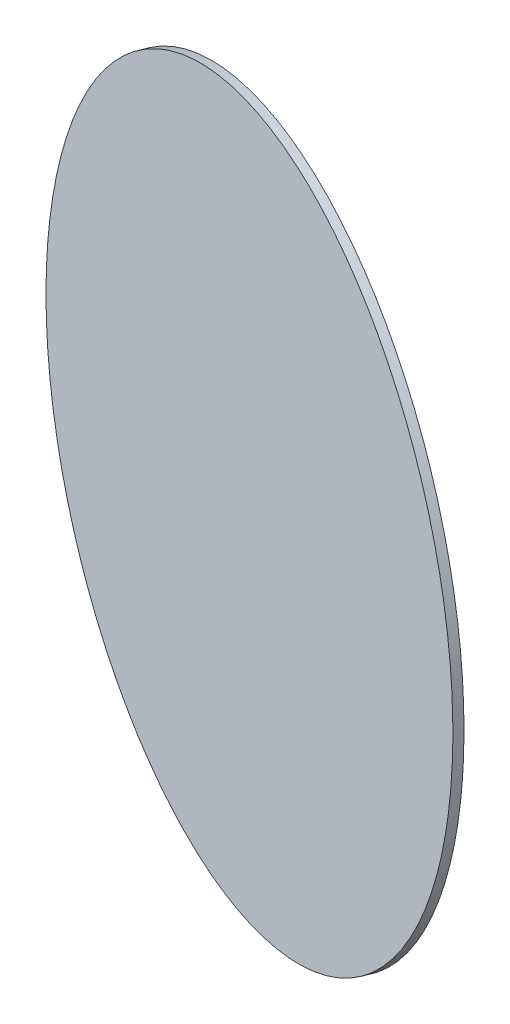
ISO-10303-21;
HEADER;
FILE_DESCRIPTION(('STEP AP214'),'2;1');
FILE_NAME('part.step','',(''),(''),'','','');
FILE_SCHEMA(('AUTOMOTIVE_DESIGN { 1 0 10303 214 1 1 1 1 }'));
ENDSEC;
DATA;
#1=APPLICATION_CONTEXT('core data for automotive mechanical design processes');
#2=APPLICATION_PROTOCOL_DEFINITION('international standard','automotive_design',2000,#1);
#3=PRODUCT_CONTEXT('',#1,'mechanical');
#4=PRODUCT('Part','Part','',(#3));
#5=PRODUCT_RELATED_PRODUCT_CATEGORY('part','',(#4));
#6=PRODUCT_DEFINITION_FORMATION('','',#4);
#7=PRODUCT_DEFINITION_CONTEXT('part definition',#1,'design');
#8=PRODUCT_DEFINITION('design','',#6,#7);
#9=PRODUCT_DEFINITION_SHAPE('','',#8);
#10=(LENGTH_UNIT() NAMED_UNIT(*) SI_UNIT(.MILLI.,.METRE.));
#11=(NAMED_UNIT(*) PLANE_ANGLE_UNIT() SI_UNIT($,.RADIAN.));
#12=(NAMED_UNIT(*) SI_UNIT($,.STERADIAN.) SOLID_ANGLE_UNIT());
#13=UNCERTAINTY_MEASURE_WITH_UNIT(LENGTH_MEASURE(1.E-05),#10,'distance_accuracy_value','');
#14=(GEOMETRIC_REPRESENTATION_CONTEXT(3) GLOBAL_UNCERTAINTY_ASSIGNED_CONTEXT((#13)) GLOBAL_UNIT_ASSIGNED_CONTEXT((#10,
#11,#12)) REPRESENTATION_CONTEXT('',''));
#15=CARTESIAN_POINT('',(0.,0.,0.));
#16=DIRECTION('',(0.,0.,1.));
#17=DIRECTION('',(1.,0.,0.));
#18=AXIS2_PLACEMENT_3D('',#15,#16,#17);
#19=CARTESIAN_POINT('',(143.675537707486,64.4027881770148,553.737754131738));
#20=CARTESIAN_POINT('',(143.57770294514,55.9951290307096,554.009753420422));
#21=CARTESIAN_POINT('',(142.60424510311,39.1798107380994,554.273991210363));
#22=CARTESIAN_POINT('',(138.824755784797,14.1997443602028,553.827248401444));
#23=CARTESIAN_POINT('',(132.762362459431,-10.2968392619625,552.541708476158));
#24=CARTESIAN_POINT('',(124.475449288777,-34.0740246369204,550.429751886734));
#25=CARTESIAN_POINT('',(114.043823776756,-56.9028244715783,547.511717929642));
#26=CARTESIAN_POINT('',(101.567948179554,-78.563384944037,543.815708867046));
#27=CARTESIAN_POINT('',(87.1679719991806,-98.84710301608,539.377319286665));
#28=CARTESIAN_POINT('',(70.9825748780801,-117.558635394465,534.239293306427));
#29=CARTESIAN_POINT('',(53.1676310383668,-134.517779793625,528.451112925254));
#30=CARTESIAN_POINT('',(33.8947081278563,-149.561210382183,522.068521484357));
#31=CARTESIAN_POINT('',(13.3494149298276,-162.544050699997,515.152986828391));
#32=CARTESIAN_POINT('',(-8.27038615102185,-173.341268897664,507.77110933651));
#33=CARTESIAN_POINT('',(-30.7564846116986,-181.84888186158,499.993980524303));
#34=CARTESIAN_POINT('',(-53.8923270318742,-187.984956628169,491.896498393646));
#35=CARTESIAN_POINT('',(-77.4551026017046,-191.690399443107,483.556646123989));
#36=CARTESIAN_POINT('',(-101.217888911729,-192.929524866487,475.054741051716));
#37=CARTESIAN_POINT('',(-124.951837339721,-191.690399443107,466.472661170287));
#38=CARTESIAN_POINT('',(-148.428376988024,-187.984956628169,457.893056600404));
#39=CARTESIAN_POINT('',(-171.421415946242,-181.84888186158,449.398553624161));
#40=CARTESIAN_POINT('',(-193.709518679934,-173.341268897664,441.070958948789));
#41=CARTESIAN_POINT('',(-215.078038575858,-162.544050699998,432.990471863338));
#42=CARTESIAN_POINT('',(-235.321185106195,-149.561210382183,425.234911875683));
#43=CARTESIAN_POINT('',(-254.244005703829,-134.517779793625,417.878969268127));
#44=CARTESIAN_POINT('',(-271.664263262139,-117.558635394465,410.993485789148));
#45=CARTESIAN_POINT('',(-287.414191177956,-98.8471030160799,404.644772408636));
#46=CARTESIAN_POINT('',(-301.342109035664,-78.563384944037,398.893970707005));
#47=CARTESIAN_POINT('',(-313.313883372521,-56.9028244715783,393.79646404835));
#48=CARTESIAN_POINT('',(-323.214219457223,-34.0740246369205,389.401344208375));
#49=CARTESIAN_POINT('',(-330.947771641201,-10.2968392619627,385.750938593755));
#50=CARTESIAN_POINT('',(-336.440061589335,14.1997443602027,382.880402606073));
#51=CARTESIAN_POINT('',(-339.638195547032,39.1798107380994,380.817381076087));
#52=CARTESIAN_POINT('',(-340.511373736001,64.4027881770146,379.581742028891));
#53=CARTESIAN_POINT('',(-339.051186972956,89.6257656159303,379.18538534398));
#54=CARTESIAN_POINT('',(-335.271697654643,114.605831993827,379.632128152899));
#55=CARTESIAN_POINT('',(-329.209304329278,139.102415615992,380.917668078185));
#56=CARTESIAN_POINT('',(-320.922391158624,162.87960099095,383.029624667608));
#57=CARTESIAN_POINT('',(-310.490765646602,185.708400825608,385.947658624701));
#58=CARTESIAN_POINT('',(-298.0148900494,207.368961298066,389.643667687297));
#59=CARTESIAN_POINT('',(-283.614913869027,227.652679370109,394.082057267678));
#60=CARTESIAN_POINT('',(-267.429516747926,246.364211748495,399.220083247915));
#61=CARTESIAN_POINT('',(-249.614572908213,263.323356147654,405.008263629089));
#62=CARTESIAN_POINT('',(-230.341649997702,278.366786736213,411.390855069986));
#63=CARTESIAN_POINT('',(-209.796356799674,291.349627054027,418.306389725952));
#64=CARTESIAN_POINT('',(-188.176555718824,302.146845251694,425.688267217833));
#65=CARTESIAN_POINT('',(-165.690457258148,310.65445821561,433.465396030039));
#66=CARTESIAN_POINT('',(-142.554614837972,316.790532982198,441.562878160697));
#67=CARTESIAN_POINT('',(-118.991839268142,320.495975797137,449.902730430354));
#68=CARTESIAN_POINT('',(-95.2290529581174,321.735101220517,458.404635502627));
#69=CARTESIAN_POINT('',(-71.4951045301253,320.495975797137,466.986715384055));
#70=CARTESIAN_POINT('',(-48.0185648818226,316.790532982198,475.566319953939));
#71=CARTESIAN_POINT('',(-25.0255259236047,310.65445821561,484.060822930182));
#72=CARTESIAN_POINT('',(-2.73742318991249,302.146845251694,492.388417605554));
#73=CARTESIAN_POINT('',(18.6310967060115,291.349627054027,500.468904691005));
#74=CARTESIAN_POINT('',(38.8742432363487,278.366786736213,508.224464678659));
#75=CARTESIAN_POINT('',(57.797063833983,263.323356147654,515.580407286216));
#76=CARTESIAN_POINT('',(75.2173213922924,246.364211748495,522.465890765195));
#77=CARTESIAN_POINT('',(90.9672493081095,227.652679370109,528.814604145707));
#78=CARTESIAN_POINT('',(104.895167165818,207.368961298067,534.565405847338));
#79=CARTESIAN_POINT('',(116.866941502674,185.708400825608,539.662912505993));
#80=CARTESIAN_POINT('',(126.767277587377,162.87960099095,544.058032345968));
#81=CARTESIAN_POINT('',(134.500829771355,139.102415615992,547.708437960588));
#82=CARTESIAN_POINT('',(139.993119719489,114.605831993827,550.578973948269));
#83=CARTESIAN_POINT('',(143.191253677186,89.6257656159303,552.641995478256));
#84=CARTESIAN_POINT('',(143.773372469832,72.8104473233199,553.465754843053));
#85=CARTESIAN_POINT('',(143.675537707486,64.4027881770148,553.737754131738));
#86=B_SPLINE_CURVE_WITH_KNOTS('',3,(#19,#20,#21,#22,#23,#24,#25,#26,#27,#28,#29,#30,#31,#32,#33,
#34,#35,#36,#37,#38,#39,#40,#41,#42,#43,#44,#45,#46,#47,#48,#49,#50,#51,#52,#53,#54,#55,#56,#57,
#58,#59,#60,#61,#62,#63,#64,#65,#66,#67,#68,#69,#70,#71,#72,#73,#74,#75,#76,#77,#78,#79,#80,#81,
#82,#83,#84,#85),.UNSPECIFIED.,.T.,.F.,(4,1,1,1,1,1,1,1,1,1,1,1,1,1,1,1,1,1,1,1,1,1,1,1,1,1,1,1,
1,1,1,1,1,1,1,1,1,1,1,1,1,1,1,1,1,1,1,1,1,1,1,1,1,1,1,1,1,1,1,1,1,1,1,1,4),(0.,0.015625,0.03125,
0.046875,0.0625,0.078125,0.09375,0.109375,0.125,0.140625,0.15625,0.171875,0.1875,0.203125,
0.21875,0.234375,0.25,0.265625,0.28125,0.296875,0.3125,0.328125,0.34375,0.359375,0.375,0.390625,
0.40625,0.421875,0.4375,0.453125,0.46875,0.484375,0.5,0.515625,0.53125,0.546875,0.5625,0.578125,
0.59375,0.609375,0.625,0.640625,0.65625,0.671875,0.6875,0.703125,0.71875,0.734375,0.75,0.765625,
0.78125,0.796875,0.8125,0.828125,0.84375,0.859375,0.875,0.890625,0.90625,0.921875,0.9375,
0.953125,0.96875,0.984375,1.),.UNSPECIFIED.);
#87=DIRECTION('',(-0.33825933679832,0.0343601668853414,0.940425435640898));
#88=VECTOR('',#87,1.);
#89=SURFACE_OF_LINEAR_EXTRUSION('',#86,#88);
#90=CARTESIAN_POINT('',(143.675537707486,64.4027881770148,553.737754131738));
#91=CARTESIAN_POINT('',(143.724455088659,68.6066177501673,553.601754487395));
#92=CARTESIAN_POINT('',(143.676148930165,72.8104473233199,553.430784744624));
#93=CARTESIAN_POINT('',(143.385439916478,81.207985175416,553.019400890538));
#94=CARTESIAN_POINT('',(143.143037061286,85.4016934543595,552.778986779223));
#95=CARTESIAN_POINT('',(142.464485036842,93.7688674238281,552.229210016359));
#96=CARTESIAN_POINT('',(142.02833586759,97.9423331143533,551.919847364811));
#97=CARTESIAN_POINT('',(140.963574539119,106.258998086373,551.233001355861));
#98=CARTESIAN_POINT('',(140.334962379902,110.402197367866,550.855517998459));
#99=CARTESIAN_POINT('',(138.886558395597,118.64830570121,550.033258412182));
#100=CARTESIAN_POINT('',(138.066766570509,122.75121475306,549.588482183305));
#101=CARTESIAN_POINT('',(136.238207160906,130.90691281497,548.632788722026));
#102=CARTESIAN_POINT('',(135.22943957639,134.959701825031,548.121871489624));
#103=CARTESIAN_POINT('',(133.025132554372,143.005329991218,547.03504788924));
#104=CARTESIAN_POINT('',(131.829593116869,146.998169147344,546.459141521259));
#105=CARTESIAN_POINT('',(129.254845652839,154.914356468452,545.243804458118));
#106=CARTESIAN_POINT('',(127.875637626313,158.837704633432,544.604373762959));
#107=CARTESIAN_POINT('',(124.936656248199,166.605368835035,543.263452853859));
#108=CARTESIAN_POINT('',(123.376882896612,170.449684871657,542.56196263992));
#109=CARTESIAN_POINT('',(120.080743603735,178.05012424063,541.098686335206));
#110=CARTESIAN_POINT('',(118.344377662445,181.806247572982,540.336900244432));
#111=CARTESIAN_POINT('',(114.699025925519,189.221140957501,538.754795827994));
#112=CARTESIAN_POINT('',(112.790040129882,192.879911009669,537.93447750233));
#113=CARTESIAN_POINT('',(108.804252631401,200.091406040563,536.237354106766));
#114=CARTESIAN_POINT('',(106.727450928556,203.644131019289,535.360549036866));
#115=CARTESIAN_POINT('',(102.410835562796,210.634844110039,533.552497643485));
#116=CARTESIAN_POINT('',(100.17102189988,214.072832222064,532.621251320004));
#117=CARTESIAN_POINT('',(95.5339715082578,220.825932275526,530.706625059631));
#118=CARTESIAN_POINT('',(93.1367347795519,224.141044216964,529.723245122739));
#119=CARTESIAN_POINT('',(88.190427150631,230.640252625369,527.706659275715));
#120=CARTESIAN_POINT('',(85.641356250416,233.824349092335,526.673453365583));
#121=CARTESIAN_POINT('',(80.3977002957943,240.054018123232,524.55976313793));
#122=CARTESIAN_POINT('',(77.7031152413876,243.099590687162,523.479278820408));
#123=CARTESIAN_POINT('',(72.1747509956999,249.044703483419,521.273579343826));
#124=CARTESIAN_POINT('',(69.3409718044189,251.944243715747,520.148364184766));
#125=CARTESIAN_POINT('',(63.5412095601144,257.590486605826,517.855965982185));
#126=CARTESIAN_POINT('',(60.575226507091,260.337189263577,516.688782938664));
#127=CARTESIAN_POINT('',(54.5180468144337,265.67095176153,514.315211924242));
#128=CARTESIAN_POINT('',(51.4268501747998,268.258011601732,513.10882395334));
#129=CARTESIAN_POINT('',(45.1268365216977,273.266451945412,510.659794823674));
#130=CARTESIAN_POINT('',(41.9180195082294,275.687832448891,509.417153664911));
#131=CARTESIAN_POINT('',(35.3903583202341,280.358877599953,506.898569899042));
#132=CARTESIAN_POINT('',(32.0715141457072,282.608542247536,505.622627291938));
#133=CARTESIAN_POINT('',(25.3319216592246,286.930946026416,503.040552724482));
#134=CARTESIAN_POINT('',(21.9111733472689,289.003685157712,501.734420764131));
#135=CARTESIAN_POINT('',(14.9758956095587,292.967028243626,499.09507958528));
#136=CARTESIAN_POINT('',(11.4613661838041,294.857632198243,497.76187036678));
#137=CARTESIAN_POINT('',(4.3471008238219,298.452372301065,495.071617151124));
#138=CARTESIAN_POINT('',(0.747364889594235,300.15650844927,493.714573153969));
#139=CARTESIAN_POINT('',(-6.52873888200846,303.373980309534,490.979892860499));
#140=CARTESIAN_POINT('',(-10.2051067193835,304.887316021593,489.602256564183));
#141=CARTESIAN_POINT('',(-17.6255306883958,307.719773136082,486.829733309436));
#142=CARTESIAN_POINT('',(-21.369586820033,309.038894538513,485.434846351005));
#143=CARTESIAN_POINT('',(-28.9164437686847,311.479509160264,482.631163409069));
#144=CARTESIAN_POINT('',(-32.7192445856991,312.601002379584,481.222367425565));
#145=CARTESIAN_POINT('',(-40.3743644245034,314.64389839535,478.394275046285));
#146=CARTESIAN_POINT('',(-44.2266834462932,315.565301191796,476.97497865051));
#147=CARTESIAN_POINT('',(-51.9716132140466,317.20555412205,474.129294059489));
#148=CARTESIAN_POINT('',(-55.8642239600102,317.924404255859,472.702905864243));
#149=CARTESIAN_POINT('',(-63.6803166798446,319.158064967509,469.846480436036));
#150=CARTESIAN_POINT('',(-67.6037986537154,319.67287554535,468.416443203074));
#151=CARTESIAN_POINT('',(-75.4722133330979,320.496970251737,465.556162461189));
#152=CARTESIAN_POINT('',(-79.4171460386095,320.806254380282,464.125918952265));
#153=CARTESIAN_POINT('',(-87.3189383938711,321.218798960775,461.268669413485));
#154=CARTESIAN_POINT('',(-91.2757980436212,321.322059412724,459.841663383628));
#155=CARTESIAN_POINT('',(-99.1919204999572,321.322059412724,456.994332558011));
#156=CARTESIAN_POINT('',(-103.151183306543,321.218798960775,455.574007762251));
#157=CARTESIAN_POINT('',(-111.062576717292,320.806254380282,452.743450987888));
#158=CARTESIAN_POINT('',(-115.014707321455,320.496970251737,451.333219009284));
#159=CARTESIAN_POINT('',(-122.902300968097,319.67287554535,448.526259452296));
#160=CARTESIAN_POINT('',(-126.837764010577,319.158064967509,447.129531873911));
#161=CARTESIAN_POINT('',(-134.682567433459,317.924404255859,444.352927673041));
#162=CARTESIAN_POINT('',(-138.591907813862,317.20555412205,442.973051050557));
#163=CARTESIAN_POINT('',(-146.375010812197,315.565301191796,440.233495317171));
#164=CARTESIAN_POINT('',(-150.248773430128,314.64389839535,438.87381620627));
#165=CARTESIAN_POINT('',(-157.951437119776,312.601002379584,436.177904795194));
#166=CARTESIAN_POINT('',(-161.780338191493,311.479509160264,434.84167249502));
#167=CARTESIAN_POINT('',(-169.383995004969,309.038894538513,432.195904004543));
#168=CARTESIAN_POINT('',(-173.158750746727,307.719773136082,430.88636781424));
#169=CARTESIAN_POINT('',(-180.645093841106,304.887316021593,428.297112293582));
#170=CARTESIAN_POINT('',(-184.356681193726,303.373980309534,427.017392963228));
#171=CARTESIAN_POINT('',(-191.707664450647,300.15650844927,424.490891912547));
#172=CARTESIAN_POINT('',(-195.347060354948,298.452372301065,423.24411019222));
#173=CARTESIAN_POINT('',(-202.544985277606,294.857632198243,420.786446508076));
#174=CARTESIAN_POINT('',(-206.103514295964,292.967028243626,419.575564544259));
#175=CARTESIAN_POINT('',(-213.13103000911,289.003685157713,417.192662519617));
#176=CARTESIAN_POINT('',(-216.600016703899,286.930946026416,416.020642458793));
#177=CARTESIAN_POINT('',(-223.440203503046,282.608542247537,413.718239255936));
#178=CARTESIAN_POINT('',(-226.811403607404,280.358877599953,412.587856113903));
#179=CARTESIAN_POINT('',(-233.447772958827,275.687832448891,410.371501764426));
#180=CARTESIAN_POINT('',(-236.712942205892,273.266451945412,409.285530556982));
#181=CARTESIAN_POINT('',(-243.129516143426,268.258011601732,407.160561236877));
#182=CARTESIAN_POINT('',(-246.280920833895,265.670951761531,406.121563124215));
#183=CARTESIAN_POINT('',(-252.462231958932,260.337189263578,404.09310115387));
#184=CARTESIAN_POINT('',(-255.492138393501,257.590486605826,403.103637296186));
#185=CARTESIAN_POINT('',(-261.423304354746,251.944243715747,401.176566475012));
#186=CARTESIAN_POINT('',(-264.324563881423,249.044703483419,400.238959511523));
#187=CARTESIAN_POINT('',(-269.991287374892,243.099590687162,398.417925117954));
#188=CARTESIAN_POINT('',(-272.756751341684,240.054018123232,397.534497687876));
#189=CARTESIAN_POINT('',(-278.14538895613,233.824349092336,395.823884111085));
#190=CARTESIAN_POINT('',(-280.768562603783,230.640252625369,394.996697964372));
#191=CARTESIAN_POINT('',(-285.866124820695,224.141044216964,393.400628704269));
#192=CARTESIAN_POINT('',(-288.340513389954,220.825932275526,392.631745590878));
#193=CARTESIAN_POINT('',(-293.134727131644,214.072832222064,391.154063402332));
#194=CARTESIAN_POINT('',(-295.454552304074,210.634844110039,390.445264327176));
#195=CARTESIAN_POINT('',(-299.93386093367,203.644131019289,389.089531220013));
#196=CARTESIAN_POINT('',(-302.093344390835,200.091406040563,388.442597188006));
#197=CARTESIAN_POINT('',(-306.246963360652,192.879911009669,387.212077274963));
#198=CARTESIAN_POINT('',(-308.241098873303,189.221140957501,386.628491393926));
#199=CARTESIAN_POINT('',(-312.05901572484,181.806247572982,385.526150890644));
#200=CARTESIAN_POINT('',(-313.882797063727,178.050124240631,385.0073962684));
#201=CARTESIAN_POINT('',(-317.355819640393,170.449684871657,384.035889210292));
#202=CARTESIAN_POINT('',(-319.005060878173,166.605368835035,383.58313677443));
#203=CARTESIAN_POINT('',(-322.124817325285,158.837704633432,382.744805016677));
#204=CARTESIAN_POINT('',(-323.595332534618,154.914356468452,382.359225694787));
#205=CARTESIAN_POINT('',(-326.354311612173,146.998169147345,381.656087635665));
#206=CARTESIAN_POINT('',(-327.642775480395,143.005329991218,381.338528898434));
#207=CARTESIAN_POINT('',(-330.034326563065,134.959701825031,380.772279479315));
#208=CARTESIAN_POINT('',(-331.137413777513,130.90691281497,380.523588797429));
#209=CARTESIAN_POINT('',(-333.155778879228,122.75121475306,380.095591341176));
#210=CARTESIAN_POINT('',(-334.071056766495,118.64830570121,379.916284566811));
#211=CARTESIAN_POINT('',(-335.711370540441,110.402197367867,379.627570777777));
#212=CARTESIAN_POINT('',(-336.43640642712,106.258998086373,379.518163763108));
#213=CARTESIAN_POINT('',(-337.694719593716,97.9423331143535,379.369428759196));
#214=CARTESIAN_POINT('',(-338.227996873632,93.7688674238283,379.330100769952));
#215=CARTESIAN_POINT('',(-339.101276220525,85.4016934543596,379.321703082618));
#216=CARTESIAN_POINT('',(-339.441278287502,81.2079851754162,379.352633384527));
#217=CARTESIAN_POINT('',(-339.927421275319,72.8104473233201,379.484593232349));
#218=CARTESIAN_POINT('',(-340.073562196159,68.6066177501675,379.585622778263));
#219=CARTESIAN_POINT('',(-340.171396958505,60.1989586038624,379.857622066948));
#220=CARTESIAN_POINT('',(-340.123090800011,55.9951290307098,380.028591809718));
#221=CARTESIAN_POINT('',(-339.832381786325,47.5975911786138,380.439975663805));
#222=CARTESIAN_POINT('',(-339.589978931133,43.4038828996704,380.68038977512));
#223=CARTESIAN_POINT('',(-338.911426906688,35.0367089302017,381.230166537984));
#224=CARTESIAN_POINT('',(-338.475277737436,30.8632432396765,381.539529189532));
#225=CARTESIAN_POINT('',(-337.410516408966,22.5465782676573,382.226375198482));
#226=CARTESIAN_POINT('',(-336.781904249748,18.4033789861633,382.603858555884));
#227=CARTESIAN_POINT('',(-335.333500265443,10.1572706528196,383.426118142162));
#228=CARTESIAN_POINT('',(-334.513708440356,6.05436160096991,383.870894371038));
#229=CARTESIAN_POINT('',(-332.685149030753,-2.10133646094038,384.826587832317));
#230=CARTESIAN_POINT('',(-331.676381446237,-6.15412547100095,385.337505064719));
#231=CARTESIAN_POINT('',(-329.472074424218,-14.1997536371881,386.424328665103));
#232=CARTESIAN_POINT('',(-328.276534986715,-18.1925927933148,387.000235033084));
#233=CARTESIAN_POINT('',(-325.701787522686,-26.1087801144219,388.215572096225));
#234=CARTESIAN_POINT('',(-324.322579496159,-30.0321282794023,388.855002791384));
#235=CARTESIAN_POINT('',(-321.383598118046,-37.799792481005,390.195923700484));
#236=CARTESIAN_POINT('',(-319.823824766459,-41.6441085176271,390.897413914423));
#237=CARTESIAN_POINT('',(-316.527685473582,-49.2445478866006,392.360690219137));
#238=CARTESIAN_POINT('',(-314.791319532292,-53.0006712189519,393.122476309911));
#239=CARTESIAN_POINT('',(-311.145967795365,-60.4155646034714,394.704580726349));
#240=CARTESIAN_POINT('',(-309.236981999729,-64.0743346556394,395.524899052013));
#241=CARTESIAN_POINT('',(-305.251194501248,-71.2858296865333,397.222022447577));
#242=CARTESIAN_POINT('',(-303.174392798403,-74.8385546652592,398.098827517477));
#243=CARTESIAN_POINT('',(-298.857777432642,-81.8292677560094,399.906878910858));
#244=CARTESIAN_POINT('',(-296.617963769726,-85.2672558680339,400.838125234339));
#245=CARTESIAN_POINT('',(-291.980913378104,-92.0203559214965,402.752751494712));
#246=CARTESIAN_POINT('',(-289.583676649398,-95.3354678629346,403.736131431604));
#247=CARTESIAN_POINT('',(-284.637369020477,-101.834676271339,405.752717278628));
#248=CARTESIAN_POINT('',(-282.088298120262,-105.018772738306,406.78592318876));
#249=CARTESIAN_POINT('',(-276.844642165641,-111.248441769202,408.899613416414));
#250=CARTESIAN_POINT('',(-274.150057111234,-114.294014333132,409.980097733935));
#251=CARTESIAN_POINT('',(-268.621692865546,-120.23912712939,412.185797210517));
#252=CARTESIAN_POINT('',(-265.787913674265,-123.138667361717,413.311012369577));
#253=CARTESIAN_POINT('',(-259.988151429961,-128.784910251796,415.603410572158));
#254=CARTESIAN_POINT('',(-257.022168376937,-131.531612909548,416.770593615679));
#255=CARTESIAN_POINT('',(-250.96498868428,-136.865375407501,419.144164630102));
#256=CARTESIAN_POINT('',(-247.873792044646,-139.452435247702,420.350552601004));
#257=CARTESIAN_POINT('',(-241.573778391544,-144.460875591383,422.799581730669));
#258=CARTESIAN_POINT('',(-238.364961378076,-146.882256094861,424.042222889432));
#259=CARTESIAN_POINT('',(-231.83730019008,-151.553301245924,426.560806655301));
#260=CARTESIAN_POINT('',(-228.518456015554,-153.802965893507,427.836749262406));
#261=CARTESIAN_POINT('',(-221.778863529071,-158.125369672387,430.418823829861));
#262=CARTESIAN_POINT('',(-218.358115217115,-160.198108803683,431.724955790212));
#263=CARTESIAN_POINT('',(-211.422837479405,-164.161451889596,434.364296969063));
#264=CARTESIAN_POINT('',(-207.90830805365,-166.052055844214,435.697506187563));
#265=CARTESIAN_POINT('',(-200.794042693668,-169.646795947036,438.387759403219));
#266=CARTESIAN_POINT('',(-197.19430675944,-171.35093209524,439.744803400374));
#267=CARTESIAN_POINT('',(-189.918202987838,-174.568403955504,442.479483693845));
#268=CARTESIAN_POINT('',(-186.241835150463,-176.081739667563,443.85711999016));
#269=CARTESIAN_POINT('',(-178.82141118145,-178.914196782053,446.629643244907));
#270=CARTESIAN_POINT('',(-175.077355049813,-180.233318184484,448.024530203338));
#271=CARTESIAN_POINT('',(-167.530498101162,-182.673932806234,450.828213145274));
#272=CARTESIAN_POINT('',(-163.727697284147,-183.795426025554,452.237009128778));
#273=CARTESIAN_POINT('',(-156.072577445343,-185.83832204132,455.065101508058));
#274=CARTESIAN_POINT('',(-152.220258423553,-186.759724837766,456.484397903833));
#275=CARTESIAN_POINT('',(-144.4753286558,-188.399977768021,459.330082494854));
#276=CARTESIAN_POINT('',(-140.582717909836,-189.118827901829,460.7564706901));
#277=CARTESIAN_POINT('',(-132.766625190002,-190.352488613479,463.612896118307));
#278=CARTESIAN_POINT('',(-128.843143216131,-190.867299191321,465.042933351269));
#279=CARTESIAN_POINT('',(-120.974728536748,-191.691393897707,467.903214093154));
#280=CARTESIAN_POINT('',(-117.029795831237,-192.000678026252,469.333457602078));
#281=CARTESIAN_POINT('',(-109.128003475975,-192.413222606746,472.190707140858));
#282=CARTESIAN_POINT('',(-105.171143826225,-192.516483058694,473.617713170715));
#283=CARTESIAN_POINT('',(-97.2550213698888,-192.516483058694,476.465043996332));
#284=CARTESIAN_POINT('',(-93.2957585633028,-192.413222606746,477.885368792092));
#285=CARTESIAN_POINT('',(-85.3843651525541,-192.000678026252,480.715925566456));
#286=CARTESIAN_POINT('',(-81.4322345483915,-191.691393897707,482.126157545059));
#287=CARTESIAN_POINT('',(-73.5446409017491,-190.867299191321,484.933117102047));
#288=CARTESIAN_POINT('',(-69.6091778592693,-190.352488613479,486.329844680432));
#289=CARTESIAN_POINT('',(-61.7643744363867,-189.118827901829,489.106448881302));
#290=CARTESIAN_POINT('',(-57.8550340559839,-188.399977768021,490.486325503787));
#291=CARTESIAN_POINT('',(-50.0719310576496,-186.759724837766,493.225881237172));
#292=CARTESIAN_POINT('',(-46.198168439718,-185.83832204132,494.585560348074));
#293=CARTESIAN_POINT('',(-38.4955047500697,-183.795426025554,497.281471759149));
#294=CARTESIAN_POINT('',(-34.6666036783529,-182.673932806234,498.617704059323));
#295=CARTESIAN_POINT('',(-27.0629468648775,-180.233318184484,501.2634725498));
#296=CARTESIAN_POINT('',(-23.2881911231189,-178.914196782053,502.573008740104));
#297=CARTESIAN_POINT('',(-15.8018480287404,-176.081739667563,505.162264260761));
#298=CARTESIAN_POINT('',(-12.0902606761204,-174.568403955504,506.441983591115));
#299=CARTESIAN_POINT('',(-4.73927741919932,-171.350932095241,508.968484641796));
#300=CARTESIAN_POINT('',(-1.09988151489827,-169.646795947036,510.215266362123));
#301=CARTESIAN_POINT('',(6.09804340776017,-166.052055844214,512.672930046268));
#302=CARTESIAN_POINT('',(9.65657242611755,-164.161451889596,513.883812010085));
#303=CARTESIAN_POINT('',(16.6840881392639,-160.198108803683,516.266714034726));
#304=CARTESIAN_POINT('',(20.1530748340529,-158.125369672387,517.43873409555));
#305=CARTESIAN_POINT('',(26.9932616332001,-153.802965893507,519.741137298407));
#306=CARTESIAN_POINT('',(30.3644617375583,-151.553301245924,520.87152044044));
#307=CARTESIAN_POINT('',(37.0008310889815,-146.882256094862,523.087874789918));
#308=CARTESIAN_POINT('',(40.2660003360465,-144.460875591383,524.173845997361));
#309=CARTESIAN_POINT('',(46.6825742735801,-139.452435247702,526.298815317467));
#310=CARTESIAN_POINT('',(49.8339789640486,-136.865375407501,527.337813430128));
#311=CARTESIAN_POINT('',(56.0152900890859,-131.531612909548,529.366275400473));
#312=CARTESIAN_POINT('',(59.0451965236546,-128.784910251796,530.355739258157));
#313=CARTESIAN_POINT('',(64.9763624849001,-123.138667361717,532.282810079331));
#314=CARTESIAN_POINT('',(67.8776220115768,-120.23912712939,533.220417042821));
#315=CARTESIAN_POINT('',(73.5443455050458,-114.294014333132,535.041451436389));
#316=CARTESIAN_POINT('',(76.3098094718381,-111.248441769202,535.924878866468));
#317=CARTESIAN_POINT('',(81.6984470862835,-105.018772738306,537.635492443258));
#318=CARTESIAN_POINT('',(84.3216207339366,-101.834676271339,538.462678589971));
#319=CARTESIAN_POINT('',(89.4191829508489,-95.3354678629347,540.058747850074));
#320=CARTESIAN_POINT('',(91.8935715201081,-92.0203559214966,540.827630963465));
#321=CARTESIAN_POINT('',(96.6877852617974,-85.267255868034,542.305313152011));
#322=CARTESIAN_POINT('',(99.0076104342275,-81.8292677560096,543.014112227167));
#323=CARTESIAN_POINT('',(103.486919063823,-74.8385546652593,544.36984533433));
#324=CARTESIAN_POINT('',(105.646402520989,-71.2858296865335,545.016779366337));
#325=CARTESIAN_POINT('',(109.800021490806,-64.0743346556396,546.247299279381));
#326=CARTESIAN_POINT('',(111.794157003457,-60.4155646034716,546.830885160417));
#327=CARTESIAN_POINT('',(115.612073854994,-53.0006712189521,547.933225663699));
#328=CARTESIAN_POINT('',(117.43585519388,-49.2445478866008,548.451980285943));
#329=CARTESIAN_POINT('',(120.908877770546,-41.6441085176273,549.423487344051));
#330=CARTESIAN_POINT('',(122.558119008326,-37.7997924810051,549.876239779913));
#331=CARTESIAN_POINT('',(125.677875455439,-30.0321282794025,550.714571537666));
#332=CARTESIAN_POINT('',(127.148390664772,-26.108780114422,551.100150859556));
#333=CARTESIAN_POINT('',(129.907369742326,-18.1925927933149,551.803288918678));
#334=CARTESIAN_POINT('',(131.195833610548,-14.1997536371883,552.120847655909));
#335=CARTESIAN_POINT('',(133.587384693218,-6.15412547100107,552.687097075028));
#336=CARTESIAN_POINT('',(134.690471907666,-2.10133646094049,552.935787756914));
#337=CARTESIAN_POINT('',(136.708837009381,6.05436160096978,553.363785213167));
#338=CARTESIAN_POINT('',(137.624114896648,10.1572706528195,553.543091987532));
#339=CARTESIAN_POINT('',(139.264428670595,18.4033789861631,553.831805776567));
#340=CARTESIAN_POINT('',(139.989464557274,22.5465782676571,553.941212791235));
#341=CARTESIAN_POINT('',(141.247777723869,30.8632432396763,554.089947795147));
#342=CARTESIAN_POINT('',(141.781055003785,35.0367089302015,554.129275784391));
#343=CARTESIAN_POINT('',(142.654334350678,43.4038828996702,554.137673471725));
#344=CARTESIAN_POINT('',(142.994336417655,47.5975911786136,554.106743169816));
#345=CARTESIAN_POINT('',(143.480479405473,55.9951290307096,553.974783321994));
#346=CARTESIAN_POINT('',(143.626620326313,60.1989586038622,553.87375377608));
#347=CARTESIAN_POINT('',(143.675537707486,64.4027881770148,553.737754131738));
#348=B_SPLINE_CURVE_WITH_KNOTS('',3,(#90,#91,#92,#93,#94,#95,#96,#97,#98,#99,#100,#101,#102,
#103,#104,#105,#106,#107,#108,#109,#110,#111,#112,#113,#114,#115,#116,#117,#118,#119,#120,#121,
#122,#123,#124,#125,#126,#127,#128,#129,#130,#131,#132,#133,#134,#135,#136,#137,#138,#139,#140,
#141,#142,#143,#144,#145,#146,#147,#148,#149,#150,#151,#152,#153,#154,#155,#156,#157,#158,#159,
#160,#161,#162,#163,#164,#165,#166,#167,#168,#169,#170,#171,#172,#173,#174,#175,#176,#177,#178,
#179,#180,#181,#182,#183,#184,#185,#186,#187,#188,#189,#190,#191,#192,#193,#194,#195,#196,#197,
#198,#199,#200,#201,#202,#203,#204,#205,#206,#207,#208,#209,#210,#211,#212,#213,#214,#215,#216,
#217,#218,#219,#220,#221,#222,#223,#224,#225,#226,#227,#228,#229,#230,#231,#232,#233,#234,#235,
#236,#237,#238,#239,#240,#241,#242,#243,#244,#245,#246,#247,#248,#249,#250,#251,#252,#253,#254,
#255,#256,#257,#258,#259,#260,#261,#262,#263,#264,#265,#266,#267,#268,#269,#270,#271,#272,#273,
#274,#275,#276,#277,#278,#279,#280,#281,#282,#283,#284,#285,#286,#287,#288,#289,#290,#291,#292,
#293,#294,#295,#296,#297,#298,#299,#300,#301,#302,#303,#304,#305,#306,#307,#308,#309,#310,#311,
#312,#313,#314,#315,#316,#317,#318,#319,#320,#321,#322,#323,#324,#325,#326,#327,#328,#329,#330,
#331,#332,#333,#334,#335,#336,#337,#338,#339,#340,#341,#342,#343,#344,#345,#346,#347),
.UNSPECIFIED.,.F.,.F.,(4,2,2,2,2,2,2,2,2,2,2,2,2,2,2,2,2,2,2,2,2,2,2,2,2,2,2,2,2,2,2,2,2,2,2,2,
2,2,2,2,2,2,2,2,2,2,2,2,2,2,2,2,2,2,2,2,2,2,2,2,2,2,2,2,2,2,2,2,2,2,2,2,2,2,2,2,2,2,2,2,2,2,2,2,
2,2,2,2,2,2,2,2,2,2,2,2,2,2,2,2,2,2,2,2,2,2,2,2,2,2,2,2,2,2,2,2,2,2,2,2,2,2,2,2,2,2,2,2,4),(0.,
12.6176781138512,25.2353562277023,37.8530343415533,50.4707124554044,63.0883905692554,
75.7060686831065,88.3237467969575,100.941424910808,113.559103024659,126.176781138511,
138.794459252362,151.412137366213,164.029815480064,176.647493593915,189.265171707766,
201.882849821617,214.500527935468,227.118206049319,239.73588416317,252.353562277021,
264.971240390872,277.588918504723,290.206596618574,302.824274732425,315.441952846276,
328.059630960127,340.677309073979,353.29498718783,365.912665301681,378.530343415532,
391.148021529383,403.765699643234,416.383377757085,429.001055870936,441.618733984787,
454.236412098638,466.854090212489,479.47176832634,492.089446440191,504.707124554042,
517.324802667893,529.942480781744,542.560158895595,555.177837009446,567.795515123298,
580.413193237149,593.030871351,605.648549464851,618.266227578702,630.883905692553,
643.501583806404,656.119261920255,668.736940034106,681.354618147957,693.972296261808,
706.589974375659,719.20765248951,731.825330603362,744.443008717213,757.060686831064,
769.678364944915,782.296043058766,794.913721172617,807.531399286468,820.149077400319,
832.76675551417,845.384433628021,858.002111741872,870.619789855723,883.237467969574,
895.855146083426,908.472824197277,921.090502311128,933.708180424979,946.32585853883,
958.943536652681,971.561214766532,984.178892880383,996.796570994234,1009.41424910809,
1022.03192722194,1034.64960533579,1047.26728344964,1059.88496156349,1072.50263967734,
1085.12031779119,1097.73799590504,1110.35567401889,1122.97335213274,1135.5910302466,
1148.20870836045,1160.8263864743,1173.44406458815,1186.061742702,1198.67942081585,
1211.2970989297,1223.91477704355,1236.5324551574,1249.15013327126,1261.76781138511,
1274.38548949896,1287.00316761281,1299.62084572666,1312.23852384051,1324.85620195436,
1337.47388006821,1350.09155818206,1362.70923629592,1375.32691440977,1387.94459252362,
1400.56227063747,1413.17994875132,1425.79762686517,1438.41530497902,1451.03298309287,
1463.65066120672,1476.26833932057,1488.88601743443,1501.50369554828,1514.12137366213,
1526.73905177598,1539.35672988983,1551.97440800368,1564.59208611753,1577.20976423138,
1589.82744234523,1602.44512045909,1615.06279857294),.UNSPECIFIED.);
#349=CARTESIAN_POINT('',(143.675537707486,64.4027881770148,553.737754131738));
#350=VERTEX_POINT('',#349);
#351=EDGE_CURVE('E9',#350,#350,#348,.F.);
#352=ORIENTED_EDGE('',*,*,#351,.F.);
#353=EDGE_LOOP('',(#352));
#354=FACE_BOUND('',#353,.T.);
#355=CARTESIAN_POINT('',(141.425864022138,64.6313085897778,559.992275812108));
#356=CARTESIAN_POINT('',(141.328029259792,56.2236494434726,560.264275100793));
#357=CARTESIAN_POINT('',(140.354571417762,39.4083311508624,560.528512890734));
#358=CARTESIAN_POINT('',(136.57508209945,14.4282647729658,560.081770081814));
#359=CARTESIAN_POINT('',(130.512688774084,-10.0683188491995,558.796230156529));
#360=CARTESIAN_POINT('',(122.22577560343,-33.8455042241574,556.684273567105));
#361=CARTESIAN_POINT('',(111.794150091408,-56.6743040588153,553.766239610012));
#362=CARTESIAN_POINT('',(99.3182744942065,-78.334864531274,550.070230547417));
#363=CARTESIAN_POINT('',(84.9182983138331,-98.6185826033169,545.631840967035));
#364=CARTESIAN_POINT('',(68.7329011927326,-117.330114981702,540.493814986798));
#365=CARTESIAN_POINT('',(50.9179573530193,-134.289259380862,534.705634605624));
#366=CARTESIAN_POINT('',(31.6450344425088,-149.33268996942,528.323043164728));
#367=CARTESIAN_POINT('',(11.0997412444801,-162.315530287234,521.407508508762));
#368=CARTESIAN_POINT('',(-10.5200598363694,-173.112748484901,514.02563101688));
#369=CARTESIAN_POINT('',(-33.0061582970462,-181.620361448817,506.248502204674));
#370=CARTESIAN_POINT('',(-56.1420007172218,-187.756436215406,498.151020074017));
#371=CARTESIAN_POINT('',(-79.7047762870521,-191.461879030344,489.811167804359));
#372=CARTESIAN_POINT('',(-103.467562597076,-192.701004453724,481.309262732086));
#373=CARTESIAN_POINT('',(-127.201511025069,-191.461879030344,472.727182850658));
#374=CARTESIAN_POINT('',(-150.678050673371,-187.756436215405,464.147578280774));
#375=CARTESIAN_POINT('',(-173.671089631589,-181.620361448817,455.653075304532));
#376=CARTESIAN_POINT('',(-195.959192365281,-173.112748484901,447.32548062916));
#377=CARTESIAN_POINT('',(-217.327712261205,-162.315530287234,439.244993543708));
#378=CARTESIAN_POINT('',(-237.570858791543,-149.33268996942,431.489433556054));
#379=CARTESIAN_POINT('',(-256.493679389177,-134.289259380862,424.133490948498));
#380=CARTESIAN_POINT('',(-273.913936947486,-117.330114981702,417.248007469519));
#381=CARTESIAN_POINT('',(-289.663864863303,-98.6185826033169,410.899294089006));
#382=CARTESIAN_POINT('',(-303.591782721012,-78.334864531274,405.148492387376));
#383=CARTESIAN_POINT('',(-315.563557057868,-56.6743040588153,400.050985728721));
#384=CARTESIAN_POINT('',(-325.463893142571,-33.8455042241574,395.655865888745));
#385=CARTESIAN_POINT('',(-333.197445326549,-10.0683188491996,392.005460274125));
#386=CARTESIAN_POINT('',(-338.689735274683,14.4282647729657,389.134924286444));
#387=CARTESIAN_POINT('',(-341.887869232379,39.4083311508624,387.071902756458));
#388=CARTESIAN_POINT('',(-342.761047421349,64.6313085897776,385.836263709262));
#389=CARTESIAN_POINT('',(-341.300860658304,89.8542860286934,385.43990702435));
#390=CARTESIAN_POINT('',(-337.521371339991,114.83435240659,385.88664983327));
#391=CARTESIAN_POINT('',(-331.458978014625,139.330936028755,387.172189758555));
#392=CARTESIAN_POINT('',(-323.172064843971,163.108121403713,389.284146347979));
#393=CARTESIAN_POINT('',(-312.74043933195,185.936921238371,392.202180305072));
#394=CARTESIAN_POINT('',(-300.264563734748,207.597481710829,395.898189367667));
#395=CARTESIAN_POINT('',(-285.864587554375,227.881199782872,400.336578948049));
#396=CARTESIAN_POINT('',(-269.679190433274,246.592732161258,405.474604928286));
#397=CARTESIAN_POINT('',(-251.864246593561,263.551876560417,411.262785309459));
#398=CARTESIAN_POINT('',(-232.59132368305,278.595307148976,417.645376750356));
#399=CARTESIAN_POINT('',(-212.046030485022,291.57814746679,424.560911406322));
#400=CARTESIAN_POINT('',(-190.426229404172,302.375365664457,431.942788898204));
#401=CARTESIAN_POINT('',(-167.940130943495,310.882978628373,439.71991771041));
#402=CARTESIAN_POINT('',(-144.80428852332,317.019053394961,447.817399841068));
#403=CARTESIAN_POINT('',(-121.241512953489,320.7244962099,456.157252110725));
#404=CARTESIAN_POINT('',(-97.478726643465,321.96362163328,464.659157182998));
#405=CARTESIAN_POINT('',(-73.7447782154729,320.7244962099,473.241237064426));
#406=CARTESIAN_POINT('',(-50.2682385671702,317.019053394961,481.82084163431));
#407=CARTESIAN_POINT('',(-27.2751996089522,310.882978628373,490.315344610552));
#408=CARTESIAN_POINT('',(-4.98709687526006,302.375365664457,498.642939285924));
#409=CARTESIAN_POINT('',(16.3814230206639,291.57814746679,506.723426371376));
#410=CARTESIAN_POINT('',(36.6245695510012,278.595307148976,514.47898635903));
#411=CARTESIAN_POINT('',(55.5473901486354,263.551876560417,521.834928966586));
#412=CARTESIAN_POINT('',(72.9676477069449,246.592732161258,528.720412445565));
#413=CARTESIAN_POINT('',(88.7175756227619,227.881199782872,535.069125826078));
#414=CARTESIAN_POINT('',(102.64549348047,207.59748171083,540.819927527709));
#415=CARTESIAN_POINT('',(114.617267817327,185.936921238371,545.917434186363));
#416=CARTESIAN_POINT('',(124.517603902029,163.108121403713,550.312554026339));
#417=CARTESIAN_POINT('',(132.251156086008,139.330936028755,553.962959640959));
#418=CARTESIAN_POINT('',(137.743446034141,114.83435240659,556.83349562864));
#419=CARTESIAN_POINT('',(140.941579991838,89.8542860286933,558.896517158626));
#420=CARTESIAN_POINT('',(141.523698784484,73.0389677360829,559.720276523424));
#421=CARTESIAN_POINT('',(141.425864022138,64.6313085897778,559.992275812108));
#422=B_SPLINE_CURVE_WITH_KNOTS('',3,(#355,#356,#357,#358,#359,#360,#361,#362,#363,#364,#365,
#366,#367,#368,#369,#370,#371,#372,#373,#374,#375,#376,#377,#378,#379,#380,#381,#382,#383,#384,
#385,#386,#387,#388,#389,#390,#391,#392,#393,#394,#395,#396,#397,#398,#399,#400,#401,#402,#403,
#404,#405,#406,#407,#408,#409,#410,#411,#412,#413,#414,#415,#416,#417,#418,#419,#420,#421),
.UNSPECIFIED.,.T.,.F.,(4,1,1,1,1,1,1,1,1,1,1,1,1,1,1,1,1,1,1,1,1,1,1,1,1,1,1,1,1,1,1,1,1,1,1,1,
1,1,1,1,1,1,1,1,1,1,1,1,1,1,1,1,1,1,1,1,1,1,1,1,1,1,1,1,4),(0.,0.015625,0.03125,0.046875,0.0625,
0.078125,0.09375,0.109375,0.125,0.140625,0.15625,0.171875,0.1875,0.203125,0.21875,0.234375,0.25,
0.265625,0.28125,0.296875,0.3125,0.328125,0.34375,0.359375,0.375,0.390625,0.40625,0.421875,
0.4375,0.453125,0.46875,0.484375,0.5,0.515625,0.53125,0.546875,0.5625,0.578125,0.59375,0.609375,
0.625,0.640625,0.65625,0.671875,0.6875,0.703125,0.71875,0.734375,0.75,0.765625,0.78125,0.796875,
0.8125,0.828125,0.84375,0.859375,0.875,0.890625,0.90625,0.921875,0.9375,0.953125,0.96875,
0.984375,1.),.UNSPECIFIED.);
#423=CARTESIAN_POINT('',(141.425864022138,64.6313085897778,559.992275812108));
#424=VERTEX_POINT('',#423);
#425=EDGE_CURVE('E24',#424,#424,#422,.T.);
#426=ORIENTED_EDGE('',*,*,#425,.T.);
#427=EDGE_LOOP('',(#426));
#428=FACE_BOUND('',#427,.T.);
#429=ADVANCED_FACE('F14',(#354,#428),#89,.F.);
#430=CARTESIAN_POINT('',(-72.9586423426934,313.122888764413,466.729688277181));
#431=DIRECTION('',(-0.33825933679832,0.0343601668853414,0.940425435640898));
#432=DIRECTION('',(-0.101059314368814,-0.994880402349602,0.));
#433=AXIS2_PLACEMENT_3D('',#430,#431,#432);
#434=PLANE('',#433);
#435=ORIENTED_EDGE('',*,*,#351,.T.);
#436=EDGE_LOOP('',(#435));
#437=FACE_BOUND('',#436,.T.);
#438=ADVANCED_FACE('F59',(#437),#434,.F.);
#439=CARTESIAN_POINT('',(-75.2083160280409,313.351409177176,472.984209957551));
#440=DIRECTION('',(-0.33825933679832,0.0343601668853414,0.940425435640898));
#441=DIRECTION('',(-0.101059314368814,-0.994880402349602,0.));
#442=AXIS2_PLACEMENT_3D('',#439,#440,#441);
#443=PLANE('',#442);
#444=ORIENTED_EDGE('',*,*,#425,.F.);
#445=EDGE_LOOP('',(#444));
#446=FACE_BOUND('',#445,.T.);
#447=ADVANCED_FACE('F67',(#446),#443,.T.);
#448=CLOSED_SHELL('',(#429,#438,#447));
#449=MANIFOLD_SOLID_BREP('B1',#448);
#450=ADVANCED_BREP_SHAPE_REPRESENTATION('',(#18,#449),#14);
#451=SHAPE_DEFINITION_REPRESENTATION(#9,#450);
ENDSEC;
END-ISO-10303-21;
